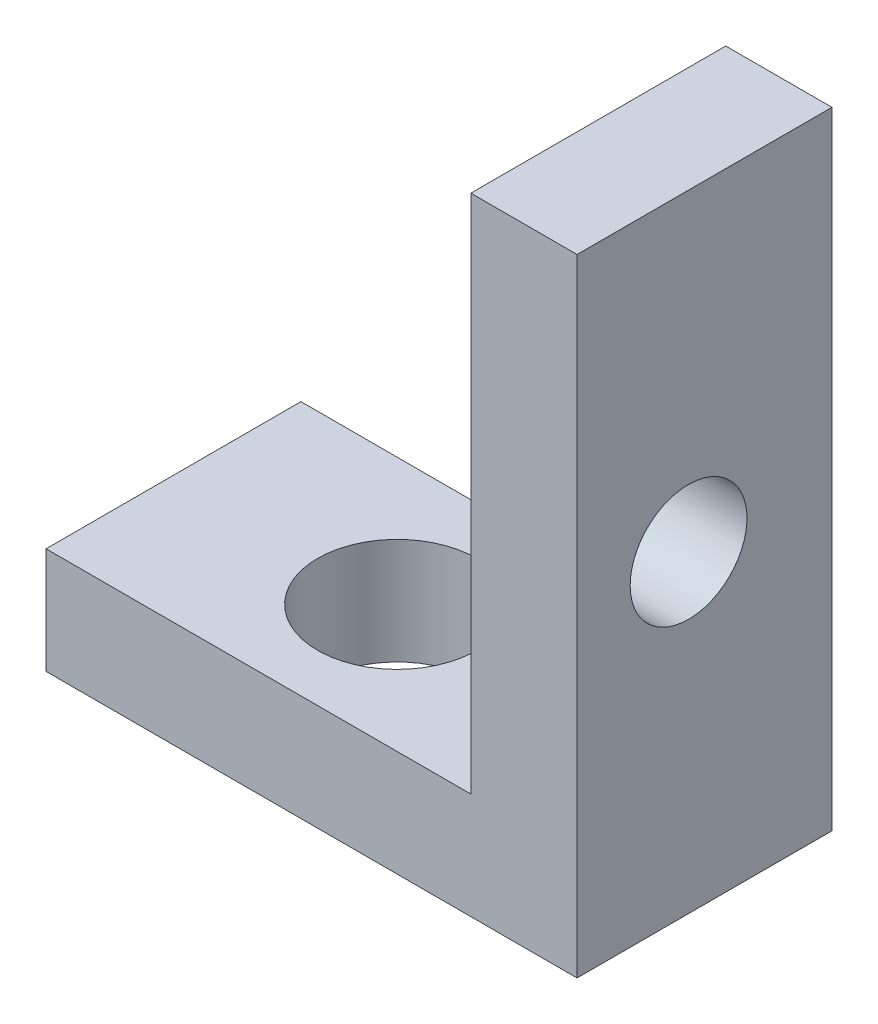
ISO-10303-21;
HEADER;
FILE_DESCRIPTION(('STEP AP214'),'2;1');
FILE_NAME('part.step','',(''),(''),'','','');
FILE_SCHEMA(('AUTOMOTIVE_DESIGN { 1 0 10303 214 1 1 1 1 }'));
ENDSEC;
DATA;
#1=APPLICATION_CONTEXT('core data for automotive mechanical design processes');
#2=APPLICATION_PROTOCOL_DEFINITION('international standard','automotive_design',2000,#1);
#3=PRODUCT_CONTEXT('',#1,'mechanical');
#4=PRODUCT('Part','Part','',(#3));
#5=PRODUCT_RELATED_PRODUCT_CATEGORY('part','',(#4));
#6=PRODUCT_DEFINITION_FORMATION('','',#4);
#7=PRODUCT_DEFINITION_CONTEXT('part definition',#1,'design');
#8=PRODUCT_DEFINITION('design','',#6,#7);
#9=PRODUCT_DEFINITION_SHAPE('','',#8);
#10=(LENGTH_UNIT() NAMED_UNIT(*) SI_UNIT(.MILLI.,.METRE.));
#11=(NAMED_UNIT(*) PLANE_ANGLE_UNIT() SI_UNIT($,.RADIAN.));
#12=(NAMED_UNIT(*) SI_UNIT($,.STERADIAN.) SOLID_ANGLE_UNIT());
#13=UNCERTAINTY_MEASURE_WITH_UNIT(LENGTH_MEASURE(1.E-05),#10,'distance_accuracy_value','');
#14=(GEOMETRIC_REPRESENTATION_CONTEXT(3) GLOBAL_UNCERTAINTY_ASSIGNED_CONTEXT((#13)) GLOBAL_UNIT_ASSIGNED_CONTEXT((#10,
#11,#12)) REPRESENTATION_CONTEXT('',''));
#15=CARTESIAN_POINT('',(0.,0.,0.));
#16=DIRECTION('',(0.,0.,1.));
#17=DIRECTION('',(1.,0.,0.));
#18=AXIS2_PLACEMENT_3D('',#15,#16,#17);
#19=CARTESIAN_POINT('',(0.,0.,4.8));
#20=DIRECTION('',(0.,1.,0.));
#21=DIRECTION('',(-1.,0.,0.));
#22=AXIS2_PLACEMENT_3D('',#19,#20,#21);
#23=PLANE('',#22);
#24=CARTESIAN_POINT('',(-5.78666309704816,0.,2.4));
#25=DIRECTION('',(0.,1.,0.));
#26=DIRECTION('',(-1.,0.,0.));
#27=AXIS2_PLACEMENT_3D('',#24,#25,#26);
#28=CIRCLE('',#27,1.5);
#29=CARTESIAN_POINT('',(-7.28666309704816,0.,2.4));
#30=VERTEX_POINT('',#29);
#31=EDGE_CURVE('E168',#30,#30,#28,.F.);
#32=ORIENTED_EDGE('',*,*,#31,.F.);
#33=EDGE_LOOP('',(#32));
#34=FACE_BOUND('',#33,.T.);
#35=DIRECTION('',(1.,0.,0.));
#36=VECTOR('',#35,1.);
#37=CARTESIAN_POINT('',(0.,0.,0.));
#38=LINE('',#37,#36);
#39=CARTESIAN_POINT('',(-10.,0.,0.));
#40=VERTEX_POINT('',#39);
#41=CARTESIAN_POINT('',(0.,0.,0.));
#42=VERTEX_POINT('',#41);
#43=EDGE_CURVE('E124',#40,#42,#38,.T.);
#44=ORIENTED_EDGE('',*,*,#43,.T.);
#45=DIRECTION('',(0.,0.,-1.));
#46=VECTOR('',#45,1.);
#47=CARTESIAN_POINT('',(0.,0.,4.8));
#48=LINE('',#47,#46);
#49=CARTESIAN_POINT('',(0.,0.,4.8));
#50=VERTEX_POINT('',#49);
#51=EDGE_CURVE('E11',#50,#42,#48,.T.);
#52=ORIENTED_EDGE('',*,*,#51,.F.);
#53=DIRECTION('',(1.,0.,0.));
#54=VECTOR('',#53,1.);
#55=CARTESIAN_POINT('',(0.,0.,4.8));
#56=LINE('',#55,#54);
#57=CARTESIAN_POINT('',(-10.,0.,4.8));
#58=VERTEX_POINT('',#57);
#59=EDGE_CURVE('E135',#58,#50,#56,.T.);
#60=ORIENTED_EDGE('',*,*,#59,.F.);
#61=DIRECTION('',(0.,0.,-1.));
#62=VECTOR('',#61,1.);
#63=CARTESIAN_POINT('',(-10.,0.,4.8));
#64=LINE('',#63,#62);
#65=EDGE_CURVE('E120',#58,#40,#64,.T.);
#66=ORIENTED_EDGE('',*,*,#65,.T.);
#67=EDGE_LOOP('',(#44,#52,#60,#66));
#68=FACE_BOUND('',#67,.T.);
#69=ADVANCED_FACE('F40',(#34,#68),#23,.F.);
#70=CARTESIAN_POINT('',(0.,0.,4.8));
#71=DIRECTION('',(-1.,0.,0.));
#72=DIRECTION('',(0.,0.,1.));
#73=AXIS2_PLACEMENT_3D('',#70,#71,#72);
#74=PLANE('',#73);
#75=CARTESIAN_POINT('',(0.,5.9,2.7));
#76=DIRECTION('',(-1.,0.,0.));
#77=DIRECTION('',(0.,0.,1.));
#78=AXIS2_PLACEMENT_3D('',#75,#76,#77);
#79=CIRCLE('',#78,1.1);
#80=CARTESIAN_POINT('',(0.,5.9,3.8));
#81=VERTEX_POINT('',#80);
#82=EDGE_CURVE('E128',#81,#81,#79,.F.);
#83=ORIENTED_EDGE('',*,*,#82,.F.);
#84=EDGE_LOOP('',(#83));
#85=FACE_BOUND('',#84,.T.);
#86=DIRECTION('',(0.,1.,0.));
#87=VECTOR('',#86,1.);
#88=CARTESIAN_POINT('',(0.,0.,0.));
#89=LINE('',#88,#87);
#90=CARTESIAN_POINT('',(0.,11.8,0.));
#91=VERTEX_POINT('',#90);
#92=EDGE_CURVE('E127',#42,#91,#89,.T.);
#93=ORIENTED_EDGE('',*,*,#92,.T.);
#94=DIRECTION('',(0.,0.,-1.));
#95=VECTOR('',#94,1.);
#96=CARTESIAN_POINT('',(0.,11.8,4.8));
#97=LINE('',#96,#95);
#98=CARTESIAN_POINT('',(0.,11.8,4.8));
#99=VERTEX_POINT('',#98);
#100=EDGE_CURVE('E48',#99,#91,#97,.T.);
#101=ORIENTED_EDGE('',*,*,#100,.F.);
#102=DIRECTION('',(0.,1.,0.));
#103=VECTOR('',#102,1.);
#104=CARTESIAN_POINT('',(0.,0.,4.8));
#105=LINE('',#104,#103);
#106=EDGE_CURVE('E93',#50,#99,#105,.T.);
#107=ORIENTED_EDGE('',*,*,#106,.F.);
#108=ORIENTED_EDGE('',*,*,#51,.T.);
#109=EDGE_LOOP('',(#93,#101,#107,#108));
#110=FACE_BOUND('',#109,.T.);
#111=ADVANCED_FACE('F160',(#85,#110),#74,.F.);
#112=CARTESIAN_POINT('',(0.,11.8,4.8));
#113=DIRECTION('',(0.,-1.,0.));
#114=DIRECTION('',(0.,0.,-1.));
#115=AXIS2_PLACEMENT_3D('',#112,#113,#114);
#116=PLANE('',#115);
#117=DIRECTION('',(-1.,0.,0.));
#118=VECTOR('',#117,1.);
#119=CARTESIAN_POINT('',(0.,11.8,0.));
#120=LINE('',#119,#118);
#121=CARTESIAN_POINT('',(-2.,11.8,0.));
#122=VERTEX_POINT('',#121);
#123=EDGE_CURVE('E130',#91,#122,#120,.T.);
#124=ORIENTED_EDGE('',*,*,#123,.T.);
#125=DIRECTION('',(0.,0.,-1.));
#126=VECTOR('',#125,1.);
#127=CARTESIAN_POINT('',(-2.,11.8,4.8));
#128=LINE('',#127,#126);
#129=CARTESIAN_POINT('',(-2.,11.8,4.8));
#130=VERTEX_POINT('',#129);
#131=EDGE_CURVE('E115',#130,#122,#128,.T.);
#132=ORIENTED_EDGE('',*,*,#131,.F.);
#133=DIRECTION('',(-1.,0.,0.));
#134=VECTOR('',#133,1.);
#135=CARTESIAN_POINT('',(0.,11.8,4.8));
#136=LINE('',#135,#134);
#137=EDGE_CURVE('E106',#99,#130,#136,.T.);
#138=ORIENTED_EDGE('',*,*,#137,.F.);
#139=ORIENTED_EDGE('',*,*,#100,.T.);
#140=EDGE_LOOP('',(#124,#132,#138,#139));
#141=FACE_BOUND('',#140,.T.);
#142=ADVANCED_FACE('F141',(#141),#116,.F.);
#143=CARTESIAN_POINT('',(-2.,2.,4.8));
#144=DIRECTION('',(1.,0.,0.));
#145=DIRECTION('',(0.,0.,-1.));
#146=AXIS2_PLACEMENT_3D('',#143,#144,#145);
#147=PLANE('',#146);
#148=CARTESIAN_POINT('',(-2.,5.9,2.7));
#149=DIRECTION('',(-1.,0.,0.));
#150=DIRECTION('',(0.,0.,1.));
#151=AXIS2_PLACEMENT_3D('',#148,#149,#150);
#152=CIRCLE('',#151,1.1);
#153=CARTESIAN_POINT('',(-2.,5.9,3.8));
#154=VERTEX_POINT('',#153);
#155=EDGE_CURVE('E170',#154,#154,#152,.T.);
#156=ORIENTED_EDGE('',*,*,#155,.F.);
#157=EDGE_LOOP('',(#156));
#158=FACE_BOUND('',#157,.T.);
#159=DIRECTION('',(0.,-1.,0.));
#160=VECTOR('',#159,1.);
#161=CARTESIAN_POINT('',(-2.,2.,0.));
#162=LINE('',#161,#160);
#163=CARTESIAN_POINT('',(-2.,2.,0.));
#164=VERTEX_POINT('',#163);
#165=EDGE_CURVE('E114',#122,#164,#162,.T.);
#166=ORIENTED_EDGE('',*,*,#165,.T.);
#167=DIRECTION('',(0.,0.,-1.));
#168=VECTOR('',#167,1.);
#169=CARTESIAN_POINT('',(-2.,2.,4.8));
#170=LINE('',#169,#168);
#171=CARTESIAN_POINT('',(-2.,2.,4.8));
#172=VERTEX_POINT('',#171);
#173=EDGE_CURVE('E111',#172,#164,#170,.T.);
#174=ORIENTED_EDGE('',*,*,#173,.F.);
#175=DIRECTION('',(0.,-1.,0.));
#176=VECTOR('',#175,1.);
#177=CARTESIAN_POINT('',(-2.,2.,4.8));
#178=LINE('',#177,#176);
#179=EDGE_CURVE('E100',#130,#172,#178,.T.);
#180=ORIENTED_EDGE('',*,*,#179,.F.);
#181=ORIENTED_EDGE('',*,*,#131,.T.);
#182=EDGE_LOOP('',(#166,#174,#180,#181));
#183=FACE_BOUND('',#182,.T.);
#184=ADVANCED_FACE('F112',(#158,#183),#147,.F.);
#185=CARTESIAN_POINT('',(-2.,2.,4.8));
#186=DIRECTION('',(0.,-1.,0.));
#187=DIRECTION('',(1.,0.,0.));
#188=AXIS2_PLACEMENT_3D('',#185,#186,#187);
#189=PLANE('',#188);
#190=CARTESIAN_POINT('',(-5.78666309704816,2.,2.4));
#191=DIRECTION('',(0.,1.,0.));
#192=DIRECTION('',(-1.,0.,0.));
#193=AXIS2_PLACEMENT_3D('',#190,#191,#192);
#194=CIRCLE('',#193,1.5);
#195=CARTESIAN_POINT('',(-7.28666309704816,2.,2.4));
#196=VERTEX_POINT('',#195);
#197=EDGE_CURVE('E171',#196,#196,#194,.T.);
#198=ORIENTED_EDGE('',*,*,#197,.F.);
#199=EDGE_LOOP('',(#198));
#200=FACE_BOUND('',#199,.T.);
#201=DIRECTION('',(-1.,0.,0.));
#202=VECTOR('',#201,1.);
#203=CARTESIAN_POINT('',(-2.,2.,0.));
#204=LINE('',#203,#202);
#205=CARTESIAN_POINT('',(-10.,2.,0.));
#206=VERTEX_POINT('',#205);
#207=EDGE_CURVE('E79',#164,#206,#204,.T.);
#208=ORIENTED_EDGE('',*,*,#207,.T.);
#209=DIRECTION('',(0.,0.,-1.));
#210=VECTOR('',#209,1.);
#211=CARTESIAN_POINT('',(-10.,2.,4.8));
#212=LINE('',#211,#210);
#213=CARTESIAN_POINT('',(-10.,2.,4.8));
#214=VERTEX_POINT('',#213);
#215=EDGE_CURVE('E116',#214,#206,#212,.T.);
#216=ORIENTED_EDGE('',*,*,#215,.F.);
#217=DIRECTION('',(-1.,0.,0.));
#218=VECTOR('',#217,1.);
#219=CARTESIAN_POINT('',(-2.,2.,4.8));
#220=LINE('',#219,#218);
#221=EDGE_CURVE('E104',#172,#214,#220,.T.);
#222=ORIENTED_EDGE('',*,*,#221,.F.);
#223=ORIENTED_EDGE('',*,*,#173,.T.);
#224=EDGE_LOOP('',(#208,#216,#222,#223));
#225=FACE_BOUND('',#224,.T.);
#226=ADVANCED_FACE('F118',(#200,#225),#189,.F.);
#227=CARTESIAN_POINT('',(-10.,0.,4.8));
#228=DIRECTION('',(1.,0.,0.));
#229=DIRECTION('',(0.,0.,-1.));
#230=AXIS2_PLACEMENT_3D('',#227,#228,#229);
#231=PLANE('',#230);
#232=DIRECTION('',(0.,-1.,0.));
#233=VECTOR('',#232,1.);
#234=CARTESIAN_POINT('',(-10.,0.,0.));
#235=LINE('',#234,#233);
#236=EDGE_CURVE('E85',#206,#40,#235,.T.);
#237=ORIENTED_EDGE('',*,*,#236,.T.);
#238=ORIENTED_EDGE('',*,*,#65,.F.);
#239=DIRECTION('',(0.,-1.,0.));
#240=VECTOR('',#239,1.);
#241=CARTESIAN_POINT('',(-10.,0.,4.8));
#242=LINE('',#241,#240);
#243=EDGE_CURVE('E56',#214,#58,#242,.T.);
#244=ORIENTED_EDGE('',*,*,#243,.F.);
#245=ORIENTED_EDGE('',*,*,#215,.T.);
#246=EDGE_LOOP('',(#237,#238,#244,#245));
#247=FACE_BOUND('',#246,.T.);
#248=ADVANCED_FACE('F148',(#247),#231,.F.);
#249=CARTESIAN_POINT('',(0.,0.,4.8));
#250=DIRECTION('',(0.,0.,-1.));
#251=DIRECTION('',(-1.,0.,0.));
#252=AXIS2_PLACEMENT_3D('',#249,#250,#251);
#253=PLANE('',#252);
#254=ORIENTED_EDGE('',*,*,#59,.T.);
#255=ORIENTED_EDGE('',*,*,#106,.T.);
#256=ORIENTED_EDGE('',*,*,#137,.T.);
#257=ORIENTED_EDGE('',*,*,#179,.T.);
#258=ORIENTED_EDGE('',*,*,#221,.T.);
#259=ORIENTED_EDGE('',*,*,#243,.T.);
#260=EDGE_LOOP('',(#254,#255,#256,#257,#258,#259));
#261=FACE_BOUND('',#260,.T.);
#262=ADVANCED_FACE('F102',(#261),#253,.F.);
#263=CARTESIAN_POINT('',(0.,0.,0.));
#264=DIRECTION('',(0.,0.,-1.));
#265=DIRECTION('',(-1.,0.,0.));
#266=AXIS2_PLACEMENT_3D('',#263,#264,#265);
#267=PLANE('',#266);
#268=ORIENTED_EDGE('',*,*,#43,.F.);
#269=ORIENTED_EDGE('',*,*,#236,.F.);
#270=ORIENTED_EDGE('',*,*,#207,.F.);
#271=ORIENTED_EDGE('',*,*,#165,.F.);
#272=ORIENTED_EDGE('',*,*,#123,.F.);
#273=ORIENTED_EDGE('',*,*,#92,.F.);
#274=EDGE_LOOP('',(#268,#269,#270,#271,#272,#273));
#275=FACE_BOUND('',#274,.T.);
#276=ADVANCED_FACE('F144',(#275),#267,.T.);
#277=CARTESIAN_POINT('',(0.00100000000000013,5.9,2.7));
#278=DIRECTION('',(-1.,0.,0.));
#279=DIRECTION('',(0.,0.,1.));
#280=AXIS2_PLACEMENT_3D('',#277,#278,#279);
#281=CYLINDRICAL_SURFACE('',#280,1.1);
#282=ORIENTED_EDGE('',*,*,#155,.T.);
#283=EDGE_LOOP('',(#282));
#284=FACE_BOUND('',#283,.T.);
#285=ORIENTED_EDGE('',*,*,#82,.T.);
#286=EDGE_LOOP('',(#285));
#287=FACE_BOUND('',#286,.T.);
#288=ADVANCED_FACE('F183',(#284,#287),#281,.F.);
#289=CARTESIAN_POINT('',(-5.78666309704816,-0.0010000000000023,2.4));
#290=DIRECTION('',(0.,1.,0.));
#291=DIRECTION('',(-1.,0.,0.));
#292=AXIS2_PLACEMENT_3D('',#289,#290,#291);
#293=CYLINDRICAL_SURFACE('',#292,1.5);
#294=ORIENTED_EDGE('',*,*,#197,.T.);
#295=EDGE_LOOP('',(#294));
#296=FACE_BOUND('',#295,.T.);
#297=ORIENTED_EDGE('',*,*,#31,.T.);
#298=EDGE_LOOP('',(#297));
#299=FACE_BOUND('',#298,.T.);
#300=ADVANCED_FACE('F185',(#296,#299),#293,.F.);
#301=CLOSED_SHELL('',(#69,#111,#142,#184,#226,#248,#262,#276,#288,#300));
#302=MANIFOLD_SOLID_BREP('B2',#301);
#303=ADVANCED_BREP_SHAPE_REPRESENTATION('',(#18,#302),#14);
#304=SHAPE_DEFINITION_REPRESENTATION(#9,#303);
ENDSEC;
END-ISO-10303-21;
